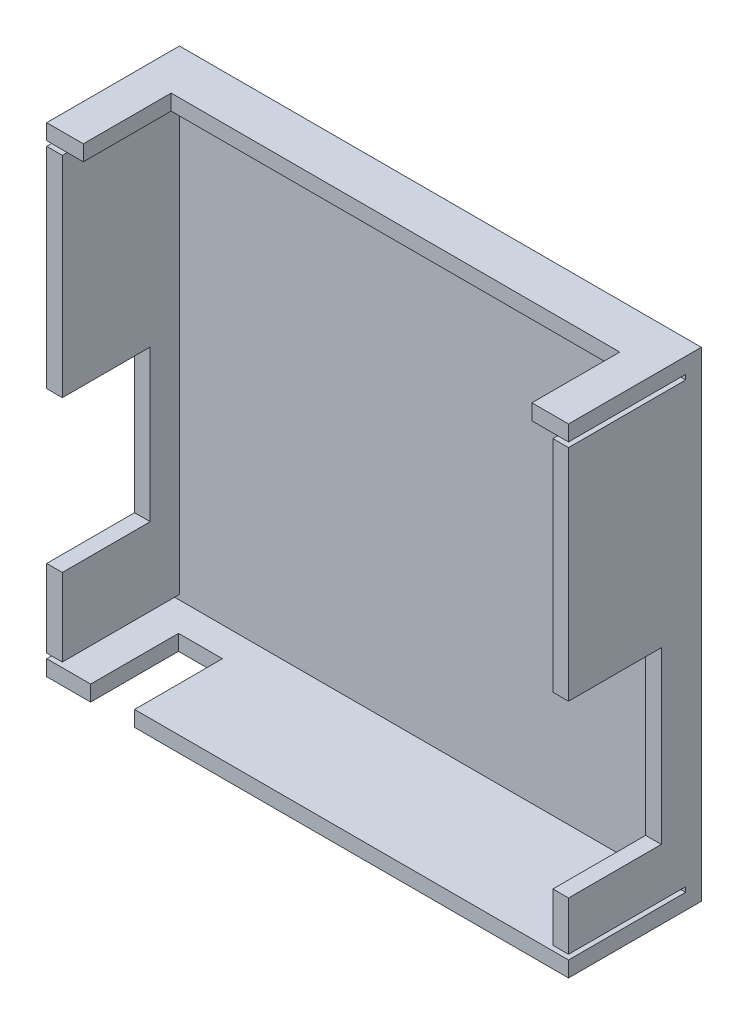
ISO-10303-21;
HEADER;
FILE_DESCRIPTION(('STEP AP214'),'2;1');
FILE_NAME('part.step','',(''),(''),'','','');
FILE_SCHEMA(('AUTOMOTIVE_DESIGN { 1 0 10303 214 1 1 1 1 }'));
ENDSEC;
DATA;
#1=APPLICATION_CONTEXT('core data for automotive mechanical design processes');
#2=APPLICATION_PROTOCOL_DEFINITION('international standard','automotive_design',2000,#1);
#3=PRODUCT_CONTEXT('',#1,'mechanical');
#4=PRODUCT('Part','Part','',(#3));
#5=PRODUCT_RELATED_PRODUCT_CATEGORY('part','',(#4));
#6=PRODUCT_DEFINITION_FORMATION('','',#4);
#7=PRODUCT_DEFINITION_CONTEXT('part definition',#1,'design');
#8=PRODUCT_DEFINITION('design','',#6,#7);
#9=PRODUCT_DEFINITION_SHAPE('','',#8);
#10=(LENGTH_UNIT() NAMED_UNIT(*) SI_UNIT(.MILLI.,.METRE.));
#11=(NAMED_UNIT(*) PLANE_ANGLE_UNIT() SI_UNIT($,.RADIAN.));
#12=(NAMED_UNIT(*) SI_UNIT($,.STERADIAN.) SOLID_ANGLE_UNIT());
#13=UNCERTAINTY_MEASURE_WITH_UNIT(LENGTH_MEASURE(1.E-05),#10,'distance_accuracy_value','');
#14=(GEOMETRIC_REPRESENTATION_CONTEXT(3) GLOBAL_UNCERTAINTY_ASSIGNED_CONTEXT((#13)) GLOBAL_UNIT_ASSIGNED_CONTEXT((#10,
#11,#12)) REPRESENTATION_CONTEXT('',''));
#15=CARTESIAN_POINT('',(0.,0.,0.));
#16=DIRECTION('',(0.,0.,1.));
#17=DIRECTION('',(1.,0.,0.));
#18=AXIS2_PLACEMENT_3D('',#15,#16,#17);
#19=CARTESIAN_POINT('',(0.,0.,27.2));
#20=DIRECTION('',(0.,0.,1.));
#21=DIRECTION('',(1.,0.,0.));
#22=AXIS2_PLACEMENT_3D('',#19,#20,#21);
#23=PLANE('',#22);
#24=DIRECTION('',(0.,1.,0.));
#25=VECTOR('',#24,1.);
#26=CARTESIAN_POINT('',(18.,3.19999999999998,27.2));
#27=LINE('',#26,#25);
#28=CARTESIAN_POINT('',(18.,0.,27.2));
#29=VERTEX_POINT('',#28);
#30=CARTESIAN_POINT('',(18.,3.19999999999998,27.2));
#31=VERTEX_POINT('',#30);
#32=EDGE_CURVE('E267',#29,#31,#27,.T.);
#33=ORIENTED_EDGE('',*,*,#32,.F.);
#34=DIRECTION('',(1.,0.,0.));
#35=VECTOR('',#34,1.);
#36=CARTESIAN_POINT('',(0.,0.,27.2));
#37=LINE('',#36,#35);
#38=CARTESIAN_POINT('',(106.9,0.,27.2));
#39=VERTEX_POINT('',#38);
#40=EDGE_CURVE('E512',#29,#39,#37,.T.);
#41=ORIENTED_EDGE('',*,*,#40,.T.);
#42=DIRECTION('',(0.,1.,0.));
#43=VECTOR('',#42,1.);
#44=CARTESIAN_POINT('',(106.9,0.,27.2));
#45=LINE('',#44,#43);
#46=CARTESIAN_POINT('',(106.9,3.2,27.2));
#47=VERTEX_POINT('',#46);
#48=EDGE_CURVE('E520',#39,#47,#45,.T.);
#49=ORIENTED_EDGE('',*,*,#48,.T.);
#50=DIRECTION('',(1.,0.,0.));
#51=VECTOR('',#50,1.);
#52=CARTESIAN_POINT('',(3.20000000000001,3.2,27.2));
#53=LINE('',#52,#51);
#54=EDGE_CURVE('E475',#31,#47,#53,.T.);
#55=ORIENTED_EDGE('',*,*,#54,.F.);
#56=EDGE_LOOP('',(#33,#41,#49,#55));
#57=FACE_BOUND('',#56,.T.);
#58=ADVANCED_FACE('F39',(#57),#23,.T.);
#59=DIRECTION('',(-1.,0.,0.));
#60=VECTOR('',#59,1.);
#61=CARTESIAN_POINT('',(103.7,49.1,27.2));
#62=LINE('',#61,#60);
#63=CARTESIAN_POINT('',(106.9,49.1,27.2));
#64=VERTEX_POINT('',#63);
#65=CARTESIAN_POINT('',(103.7,49.1,27.2));
#66=VERTEX_POINT('',#65);
#67=EDGE_CURVE('E286',#64,#66,#62,.T.);
#68=ORIENTED_EDGE('',*,*,#67,.F.);
#69=CARTESIAN_POINT('',(106.9,94.1,27.2));
#70=VERTEX_POINT('',#69);
#71=EDGE_CURVE('E526',#64,#70,#45,.T.);
#72=ORIENTED_EDGE('',*,*,#71,.T.);
#73=DIRECTION('',(-1.,0.,0.));
#74=VECTOR('',#73,1.);
#75=CARTESIAN_POINT('',(0.,94.1,27.2));
#76=LINE('',#75,#74);
#77=CARTESIAN_POINT('',(103.7,94.1,27.2));
#78=VERTEX_POINT('',#77);
#79=EDGE_CURVE('E398',#70,#78,#76,.T.);
#80=ORIENTED_EDGE('',*,*,#79,.T.);
#81=DIRECTION('',(0.,1.,0.));
#82=VECTOR('',#81,1.);
#83=CARTESIAN_POINT('',(103.7,3.2,27.2));
#84=LINE('',#83,#82);
#85=EDGE_CURVE('E479',#66,#78,#84,.T.);
#86=ORIENTED_EDGE('',*,*,#85,.F.);
#87=EDGE_LOOP('',(#68,#72,#80,#86));
#88=FACE_BOUND('',#87,.T.);
#89=ADVANCED_FACE('F694',(#88),#23,.T.);
#90=DIRECTION('',(0.,1.,0.));
#91=VECTOR('',#90,1.);
#92=CARTESIAN_POINT('',(99.4,95.1,27.2));
#93=LINE('',#92,#91);
#94=CARTESIAN_POINT('',(99.4,95.1,27.2));
#95=VERTEX_POINT('',#94);
#96=CARTESIAN_POINT('',(99.4,98.3,27.2));
#97=VERTEX_POINT('',#96);
#98=EDGE_CURVE('E321',#95,#97,#93,.T.);
#99=ORIENTED_EDGE('',*,*,#98,.F.);
#100=DIRECTION('',(-1.,0.,0.));
#101=VECTOR('',#100,1.);
#102=CARTESIAN_POINT('',(3.20000000000001,95.1,27.2));
#103=LINE('',#102,#101);
#104=CARTESIAN_POINT('',(106.9,95.1,27.2));
#105=VERTEX_POINT('',#104);
#106=EDGE_CURVE('E485',#105,#95,#103,.T.);
#107=ORIENTED_EDGE('',*,*,#106,.F.);
#108=CARTESIAN_POINT('',(106.9,98.3,27.2));
#109=VERTEX_POINT('',#108);
#110=EDGE_CURVE('E519',#105,#109,#45,.T.);
#111=ORIENTED_EDGE('',*,*,#110,.T.);
#112=DIRECTION('',(-1.,0.,0.));
#113=VECTOR('',#112,1.);
#114=CARTESIAN_POINT('',(106.9,98.3,27.2));
#115=LINE('',#114,#113);
#116=EDGE_CURVE('E503',#109,#97,#115,.T.);
#117=ORIENTED_EDGE('',*,*,#116,.T.);
#118=EDGE_LOOP('',(#99,#107,#111,#117));
#119=FACE_BOUND('',#118,.T.);
#120=ADVANCED_FACE('F667',(#119),#23,.T.);
#121=DIRECTION('',(-1.,0.,0.));
#122=VECTOR('',#121,1.);
#123=CARTESIAN_POINT('',(0.,51.1,27.2));
#124=LINE('',#123,#122);
#125=CARTESIAN_POINT('',(3.20000000000001,51.1,27.2));
#126=VERTEX_POINT('',#125);
#127=CARTESIAN_POINT('',(0.,51.1,27.2));
#128=VERTEX_POINT('',#127);
#129=EDGE_CURVE('E355',#126,#128,#124,.T.);
#130=ORIENTED_EDGE('',*,*,#129,.F.);
#131=DIRECTION('',(0.,-1.,0.));
#132=VECTOR('',#131,1.);
#133=CARTESIAN_POINT('',(3.20000000000001,3.2,27.2));
#134=LINE('',#133,#132);
#135=CARTESIAN_POINT('',(3.20000000000001,94.1,27.2));
#136=VERTEX_POINT('',#135);
#137=EDGE_CURVE('E471',#136,#126,#134,.T.);
#138=ORIENTED_EDGE('',*,*,#137,.F.);
#139=DIRECTION('',(1.,0.,0.));
#140=VECTOR('',#139,1.);
#141=CARTESIAN_POINT('',(0.,94.1,27.2));
#142=LINE('',#141,#140);
#143=CARTESIAN_POINT('',(0.,94.1,27.2));
#144=VERTEX_POINT('',#143);
#145=EDGE_CURVE('E402',#144,#136,#142,.T.);
#146=ORIENTED_EDGE('',*,*,#145,.F.);
#147=DIRECTION('',(0.,-1.,0.));
#148=VECTOR('',#147,1.);
#149=CARTESIAN_POINT('',(0.,98.3,27.2));
#150=LINE('',#149,#148);
#151=EDGE_CURVE('E513',#144,#128,#150,.T.);
#152=ORIENTED_EDGE('',*,*,#151,.T.);
#153=EDGE_LOOP('',(#130,#138,#146,#152));
#154=FACE_BOUND('',#153,.T.);
#155=ADVANCED_FACE('F644',(#154),#23,.T.);
#156=CARTESIAN_POINT('',(0.,0.,3.2));
#157=DIRECTION('',(1.,0.,0.));
#158=DIRECTION('',(0.,0.,-1.));
#159=AXIS2_PLACEMENT_3D('',#156,#157,#158);
#160=PLANE('',#159);
#161=DIRECTION('',(0.,-1.,0.));
#162=VECTOR('',#161,1.);
#163=CARTESIAN_POINT('',(0.,51.1,9.2));
#164=LINE('',#163,#162);
#165=CARTESIAN_POINT('',(0.,51.1,9.2));
#166=VERTEX_POINT('',#165);
#167=CARTESIAN_POINT('',(0.,20.1,9.2));
#168=VERTEX_POINT('',#167);
#169=EDGE_CURVE('E350',#166,#168,#164,.T.);
#170=ORIENTED_EDGE('',*,*,#169,.F.);
#171=DIRECTION('',(0.,0.,1.));
#172=VECTOR('',#171,1.);
#173=CARTESIAN_POINT('',(0.,51.1,9.2));
#174=LINE('',#173,#172);
#175=EDGE_CURVE('E370',#166,#128,#174,.T.);
#176=ORIENTED_EDGE('',*,*,#175,.T.);
#177=ORIENTED_EDGE('',*,*,#151,.F.);
#178=DIRECTION('',(0.,0.,1.));
#179=VECTOR('',#178,1.);
#180=CARTESIAN_POINT('',(0.,94.1,3.2));
#181=LINE('',#180,#179);
#182=CARTESIAN_POINT('',(0.,94.1,3.2));
#183=VERTEX_POINT('',#182);
#184=EDGE_CURVE('E457',#183,#144,#181,.T.);
#185=ORIENTED_EDGE('',*,*,#184,.F.);
#186=DIRECTION('',(0.,-1.,0.));
#187=VECTOR('',#186,1.);
#188=CARTESIAN_POINT('',(0.,0.,3.2));
#189=LINE('',#188,#187);
#190=CARTESIAN_POINT('',(0.,95.1,3.2));
#191=VERTEX_POINT('',#190);
#192=EDGE_CURVE('E450',#191,#183,#189,.T.);
#193=ORIENTED_EDGE('',*,*,#192,.F.);
#194=DIRECTION('',(0.,0.,1.));
#195=VECTOR('',#194,1.);
#196=CARTESIAN_POINT('',(0.,95.1,3.2));
#197=LINE('',#196,#195);
#198=CARTESIAN_POINT('',(0.,95.1,27.2));
#199=VERTEX_POINT('',#198);
#200=EDGE_CURVE('E460',#191,#199,#197,.T.);
#201=ORIENTED_EDGE('',*,*,#200,.T.);
#202=CARTESIAN_POINT('',(0.,98.3,27.2));
#203=VERTEX_POINT('',#202);
#204=EDGE_CURVE('E508',#203,#199,#150,.T.);
#205=ORIENTED_EDGE('',*,*,#204,.F.);
#206=DIRECTION('',(0.,0.,-1.));
#207=VECTOR('',#206,1.);
#208=CARTESIAN_POINT('',(0.,98.3,3.2));
#209=LINE('',#208,#207);
#210=CARTESIAN_POINT('',(0.,98.3,0.));
#211=VERTEX_POINT('',#210);
#212=EDGE_CURVE('E539',#203,#211,#209,.T.);
#213=ORIENTED_EDGE('',*,*,#212,.T.);
#214=DIRECTION('',(0.,-1.,0.));
#215=VECTOR('',#214,1.);
#216=CARTESIAN_POINT('',(0.,0.,0.));
#217=LINE('',#216,#215);
#218=CARTESIAN_POINT('',(0.,0.,0.));
#219=VERTEX_POINT('',#218);
#220=EDGE_CURVE('E524',#211,#219,#217,.T.);
#221=ORIENTED_EDGE('',*,*,#220,.T.);
#222=DIRECTION('',(0.,0.,-1.));
#223=VECTOR('',#222,1.);
#224=CARTESIAN_POINT('',(0.,0.,3.2));
#225=LINE('',#224,#223);
#226=CARTESIAN_POINT('',(0.,0.,27.2));
#227=VERTEX_POINT('',#226);
#228=EDGE_CURVE('E11',#227,#219,#225,.T.);
#229=ORIENTED_EDGE('',*,*,#228,.F.);
#230=CARTESIAN_POINT('',(0.,3.2,27.2));
#231=VERTEX_POINT('',#230);
#232=EDGE_CURVE('E507',#231,#227,#150,.T.);
#233=ORIENTED_EDGE('',*,*,#232,.F.);
#234=DIRECTION('',(0.,0.,1.));
#235=VECTOR('',#234,1.);
#236=CARTESIAN_POINT('',(0.,3.2,3.2));
#237=LINE('',#236,#235);
#238=CARTESIAN_POINT('',(0.,3.2,3.2));
#239=VERTEX_POINT('',#238);
#240=EDGE_CURVE('E437',#239,#231,#237,.T.);
#241=ORIENTED_EDGE('',*,*,#240,.F.);
#242=DIRECTION('',(0.,1.,0.));
#243=VECTOR('',#242,1.);
#244=CARTESIAN_POINT('',(0.,3.2,3.2));
#245=LINE('',#244,#243);
#246=CARTESIAN_POINT('',(0.,4.2,3.2));
#247=VERTEX_POINT('',#246);
#248=EDGE_CURVE('E444',#239,#247,#245,.T.);
#249=ORIENTED_EDGE('',*,*,#248,.T.);
#250=DIRECTION('',(0.,0.,1.));
#251=VECTOR('',#250,1.);
#252=CARTESIAN_POINT('',(0.,4.2,3.2));
#253=LINE('',#252,#251);
#254=CARTESIAN_POINT('',(0.,4.2,27.2));
#255=VERTEX_POINT('',#254);
#256=EDGE_CURVE('E374',#247,#255,#253,.T.);
#257=ORIENTED_EDGE('',*,*,#256,.T.);
#258=CARTESIAN_POINT('',(0.,20.1,27.2));
#259=VERTEX_POINT('',#258);
#260=EDGE_CURVE('E514',#259,#255,#150,.T.);
#261=ORIENTED_EDGE('',*,*,#260,.F.);
#262=DIRECTION('',(0.,0.,1.));
#263=VECTOR('',#262,1.);
#264=CARTESIAN_POINT('',(0.,20.1,9.2));
#265=LINE('',#264,#263);
#266=EDGE_CURVE('E365',#168,#259,#265,.T.);
#267=ORIENTED_EDGE('',*,*,#266,.F.);
#268=EDGE_LOOP('',(#170,#176,#177,#185,#193,#201,#205,#213,#221,#229,#233,#241,#249,#257,#261,#267));
#269=FACE_BOUND('',#268,.T.);
#270=ADVANCED_FACE('F41',(#269),#160,.F.);
#271=CARTESIAN_POINT('',(106.9,0.,3.2));
#272=DIRECTION('',(-1.,0.,0.));
#273=DIRECTION('',(0.,0.,1.));
#274=AXIS2_PLACEMENT_3D('',#271,#272,#273);
#275=PLANE('',#274);
#276=ORIENTED_EDGE('',*,*,#71,.F.);
#277=DIRECTION('',(0.,0.,1.));
#278=VECTOR('',#277,1.);
#279=CARTESIAN_POINT('',(106.9,49.1,8.2));
#280=LINE('',#279,#278);
#281=CARTESIAN_POINT('',(106.9,49.1,8.2));
#282=VERTEX_POINT('',#281);
#283=EDGE_CURVE('E307',#282,#64,#280,.T.);
#284=ORIENTED_EDGE('',*,*,#283,.F.);
#285=DIRECTION('',(0.,1.,0.));
#286=VECTOR('',#285,1.);
#287=CARTESIAN_POINT('',(106.9,14.2,8.2));
#288=LINE('',#287,#286);
#289=CARTESIAN_POINT('',(106.9,14.2,8.2));
#290=VERTEX_POINT('',#289);
#291=EDGE_CURVE('E290',#290,#282,#288,.T.);
#292=ORIENTED_EDGE('',*,*,#291,.F.);
#293=DIRECTION('',(0.,0.,1.));
#294=VECTOR('',#293,1.);
#295=CARTESIAN_POINT('',(106.9,14.2,8.2));
#296=LINE('',#295,#294);
#297=CARTESIAN_POINT('',(106.9,14.2,27.2));
#298=VERTEX_POINT('',#297);
#299=EDGE_CURVE('E310',#290,#298,#296,.T.);
#300=ORIENTED_EDGE('',*,*,#299,.T.);
#301=CARTESIAN_POINT('',(106.9,4.2,27.2));
#302=VERTEX_POINT('',#301);
#303=EDGE_CURVE('E525',#302,#298,#45,.T.);
#304=ORIENTED_EDGE('',*,*,#303,.F.);
#305=DIRECTION('',(0.,0.,1.));
#306=VECTOR('',#305,1.);
#307=CARTESIAN_POINT('',(106.9,4.2,3.2));
#308=LINE('',#307,#306);
#309=CARTESIAN_POINT('',(106.9,4.2,3.2));
#310=VERTEX_POINT('',#309);
#311=EDGE_CURVE('E409',#310,#302,#308,.T.);
#312=ORIENTED_EDGE('',*,*,#311,.F.);
#313=DIRECTION('',(0.,1.,0.));
#314=VECTOR('',#313,1.);
#315=CARTESIAN_POINT('',(106.9,0.,3.2));
#316=LINE('',#315,#314);
#317=CARTESIAN_POINT('',(106.9,3.2,3.2));
#318=VERTEX_POINT('',#317);
#319=EDGE_CURVE('E424',#318,#310,#316,.T.);
#320=ORIENTED_EDGE('',*,*,#319,.F.);
#321=DIRECTION('',(0.,0.,1.));
#322=VECTOR('',#321,1.);
#323=CARTESIAN_POINT('',(106.9,3.2,3.2));
#324=LINE('',#323,#322);
#325=EDGE_CURVE('E417',#318,#47,#324,.T.);
#326=ORIENTED_EDGE('',*,*,#325,.T.);
#327=ORIENTED_EDGE('',*,*,#48,.F.);
#328=DIRECTION('',(0.,0.,-1.));
#329=VECTOR('',#328,1.);
#330=CARTESIAN_POINT('',(106.9,0.,3.2));
#331=LINE('',#330,#329);
#332=CARTESIAN_POINT('',(106.9,0.,0.));
#333=VERTEX_POINT('',#332);
#334=EDGE_CURVE('E48',#39,#333,#331,.T.);
#335=ORIENTED_EDGE('',*,*,#334,.T.);
#336=DIRECTION('',(0.,1.,0.));
#337=VECTOR('',#336,1.);
#338=CARTESIAN_POINT('',(106.9,0.,0.));
#339=LINE('',#338,#337);
#340=CARTESIAN_POINT('',(106.9,98.3,0.));
#341=VERTEX_POINT('',#340);
#342=EDGE_CURVE('E533',#333,#341,#339,.T.);
#343=ORIENTED_EDGE('',*,*,#342,.T.);
#344=DIRECTION('',(0.,0.,-1.));
#345=VECTOR('',#344,1.);
#346=CARTESIAN_POINT('',(106.9,98.3,3.2));
#347=LINE('',#346,#345);
#348=EDGE_CURVE('E543',#109,#341,#347,.T.);
#349=ORIENTED_EDGE('',*,*,#348,.F.);
#350=ORIENTED_EDGE('',*,*,#110,.F.);
#351=DIRECTION('',(0.,0.,1.));
#352=VECTOR('',#351,1.);
#353=CARTESIAN_POINT('',(106.9,95.1,3.2));
#354=LINE('',#353,#352);
#355=CARTESIAN_POINT('',(106.9,95.1,3.2));
#356=VERTEX_POINT('',#355);
#357=EDGE_CURVE('E389',#356,#105,#354,.T.);
#358=ORIENTED_EDGE('',*,*,#357,.F.);
#359=DIRECTION('',(0.,1.,0.));
#360=VECTOR('',#359,1.);
#361=CARTESIAN_POINT('',(106.9,0.,3.2));
#362=LINE('',#361,#360);
#363=CARTESIAN_POINT('',(106.9,94.1,3.2));
#364=VERTEX_POINT('',#363);
#365=EDGE_CURVE('E388',#364,#356,#362,.T.);
#366=ORIENTED_EDGE('',*,*,#365,.F.);
#367=DIRECTION('',(0.,0.,1.));
#368=VECTOR('',#367,1.);
#369=CARTESIAN_POINT('',(106.9,94.1,3.2));
#370=LINE('',#369,#368);
#371=EDGE_CURVE('E384',#364,#70,#370,.T.);
#372=ORIENTED_EDGE('',*,*,#371,.T.);
#373=EDGE_LOOP('',(#276,#284,#292,#300,#304,#312,#320,#326,#327,#335,#343,#349,#350,#358,#366,#372));
#374=FACE_BOUND('',#373,.T.);
#375=ADVANCED_FACE('F553',(#374),#275,.F.);
#376=DIRECTION('',(1.,0.,0.));
#377=VECTOR('',#376,1.);
#378=CARTESIAN_POINT('',(0.,20.1,27.2));
#379=LINE('',#378,#377);
#380=CARTESIAN_POINT('',(3.20000000000001,20.1,27.2));
#381=VERTEX_POINT('',#380);
#382=EDGE_CURVE('E340',#259,#381,#379,.T.);
#383=ORIENTED_EDGE('',*,*,#382,.F.);
#384=ORIENTED_EDGE('',*,*,#260,.T.);
#385=DIRECTION('',(1.,0.,0.));
#386=VECTOR('',#385,1.);
#387=CARTESIAN_POINT('',(0.,4.2,27.2));
#388=LINE('',#387,#386);
#389=CARTESIAN_POINT('',(3.20000000000001,4.2,27.2));
#390=VERTEX_POINT('',#389);
#391=EDGE_CURVE('E421',#255,#390,#388,.T.);
#392=ORIENTED_EDGE('',*,*,#391,.T.);
#393=EDGE_CURVE('E476',#381,#390,#134,.T.);
#394=ORIENTED_EDGE('',*,*,#393,.F.);
#395=EDGE_LOOP('',(#383,#384,#392,#394));
#396=FACE_BOUND('',#395,.T.);
#397=ADVANCED_FACE('F625',(#396),#23,.T.);
#398=DIRECTION('',(0.,-1.,0.));
#399=VECTOR('',#398,1.);
#400=CARTESIAN_POINT('',(9.,3.19999999999998,27.2));
#401=LINE('',#400,#399);
#402=CARTESIAN_POINT('',(9.,3.19999999999998,27.2));
#403=VERTEX_POINT('',#402);
#404=CARTESIAN_POINT('',(9.,0.,27.2));
#405=VERTEX_POINT('',#404);
#406=EDGE_CURVE('E593',#403,#405,#401,.T.);
#407=ORIENTED_EDGE('',*,*,#406,.F.);
#408=EDGE_CURVE('E272',#231,#403,#53,.T.);
#409=ORIENTED_EDGE('',*,*,#408,.F.);
#410=ORIENTED_EDGE('',*,*,#232,.T.);
#411=EDGE_CURVE('E515',#227,#405,#37,.T.);
#412=ORIENTED_EDGE('',*,*,#411,.T.);
#413=EDGE_LOOP('',(#407,#409,#410,#412));
#414=FACE_BOUND('',#413,.T.);
#415=ADVANCED_FACE('F607',(#414),#23,.T.);
#416=DIRECTION('',(1.,0.,0.));
#417=VECTOR('',#416,1.);
#418=CARTESIAN_POINT('',(103.7,14.2,27.2));
#419=LINE('',#418,#417);
#420=CARTESIAN_POINT('',(103.7,14.2,27.2));
#421=VERTEX_POINT('',#420);
#422=EDGE_CURVE('E296',#421,#298,#419,.T.);
#423=ORIENTED_EDGE('',*,*,#422,.F.);
#424=CARTESIAN_POINT('',(103.7,4.2,27.2));
#425=VERTEX_POINT('',#424);
#426=EDGE_CURVE('E480',#425,#421,#84,.T.);
#427=ORIENTED_EDGE('',*,*,#426,.F.);
#428=DIRECTION('',(-1.,0.,0.));
#429=VECTOR('',#428,1.);
#430=CARTESIAN_POINT('',(0.,4.2,27.2));
#431=LINE('',#430,#429);
#432=EDGE_CURVE('E397',#302,#425,#431,.T.);
#433=ORIENTED_EDGE('',*,*,#432,.F.);
#434=ORIENTED_EDGE('',*,*,#303,.T.);
#435=EDGE_LOOP('',(#423,#427,#433,#434));
#436=FACE_BOUND('',#435,.T.);
#437=ADVANCED_FACE('F675',(#436),#23,.T.);
#438=DIRECTION('',(0.,-1.,0.));
#439=VECTOR('',#438,1.);
#440=CARTESIAN_POINT('',(7.49999999999999,98.3,27.2));
#441=LINE('',#440,#439);
#442=CARTESIAN_POINT('',(7.49999999999999,98.3,27.2));
#443=VERTEX_POINT('',#442);
#444=CARTESIAN_POINT('',(7.5,95.1,27.2));
#445=VERTEX_POINT('',#444);
#446=EDGE_CURVE('E306',#443,#445,#441,.T.);
#447=ORIENTED_EDGE('',*,*,#446,.F.);
#448=EDGE_CURVE('E489',#443,#203,#115,.T.);
#449=ORIENTED_EDGE('',*,*,#448,.T.);
#450=ORIENTED_EDGE('',*,*,#204,.T.);
#451=EDGE_CURVE('E484',#445,#199,#103,.T.);
#452=ORIENTED_EDGE('',*,*,#451,.F.);
#453=EDGE_LOOP('',(#447,#449,#450,#452));
#454=FACE_BOUND('',#453,.T.);
#455=ADVANCED_FACE('F576',(#454),#23,.T.);
#456=CARTESIAN_POINT('',(3.20000000000001,3.2,27.2));
#457=DIRECTION('',(1.,0.,0.));
#458=DIRECTION('',(0.,1.,0.));
#459=AXIS2_PLACEMENT_3D('',#456,#457,#458);
#460=PLANE('',#459);
#461=DIRECTION('',(0.,0.,1.));
#462=VECTOR('',#461,1.);
#463=CARTESIAN_POINT('',(3.20000000000001,51.1,9.2));
#464=LINE('',#463,#462);
#465=CARTESIAN_POINT('',(3.20000000000001,51.1,9.2));
#466=VERTEX_POINT('',#465);
#467=EDGE_CURVE('E375',#466,#126,#464,.T.);
#468=ORIENTED_EDGE('',*,*,#467,.F.);
#469=DIRECTION('',(0.,1.,0.));
#470=VECTOR('',#469,1.);
#471=CARTESIAN_POINT('',(3.20000000000001,20.1,9.2));
#472=LINE('',#471,#470);
#473=CARTESIAN_POINT('',(3.20000000000001,20.1,9.2));
#474=VERTEX_POINT('',#473);
#475=EDGE_CURVE('E358',#474,#466,#472,.T.);
#476=ORIENTED_EDGE('',*,*,#475,.F.);
#477=DIRECTION('',(0.,0.,1.));
#478=VECTOR('',#477,1.);
#479=CARTESIAN_POINT('',(3.20000000000001,20.1,9.2));
#480=LINE('',#479,#478);
#481=EDGE_CURVE('E378',#474,#381,#480,.T.);
#482=ORIENTED_EDGE('',*,*,#481,.T.);
#483=ORIENTED_EDGE('',*,*,#393,.T.);
#484=DIRECTION('',(0.,0.,1.));
#485=VECTOR('',#484,1.);
#486=CARTESIAN_POINT('',(3.20000000000001,4.2,3.2));
#487=LINE('',#486,#485);
#488=CARTESIAN_POINT('',(3.20000000000001,4.2,3.2));
#489=VERTEX_POINT('',#488);
#490=EDGE_CURVE('E433',#489,#390,#487,.T.);
#491=ORIENTED_EDGE('',*,*,#490,.F.);
#492=DIRECTION('',(0.,-1.,0.));
#493=VECTOR('',#492,1.);
#494=CARTESIAN_POINT('',(3.20000000000001,3.2,3.2));
#495=LINE('',#494,#493);
#496=CARTESIAN_POINT('',(3.20000000000001,94.1,3.2));
#497=VERTEX_POINT('',#496);
#498=EDGE_CURVE('E464',#497,#489,#495,.T.);
#499=ORIENTED_EDGE('',*,*,#498,.F.);
#500=DIRECTION('',(0.,0.,1.));
#501=VECTOR('',#500,1.);
#502=CARTESIAN_POINT('',(3.20000000000001,94.1,3.2));
#503=LINE('',#502,#501);
#504=EDGE_CURVE('E465',#497,#136,#503,.T.);
#505=ORIENTED_EDGE('',*,*,#504,.T.);
#506=ORIENTED_EDGE('',*,*,#137,.T.);
#507=EDGE_LOOP('',(#468,#476,#482,#483,#491,#499,#505,#506));
#508=FACE_BOUND('',#507,.T.);
#509=ADVANCED_FACE('F633',(#508),#460,.T.);
#510=CARTESIAN_POINT('',(103.7,3.2,27.2));
#511=DIRECTION('',(-1.,0.,0.));
#512=DIRECTION('',(0.,0.,1.));
#513=AXIS2_PLACEMENT_3D('',#510,#511,#512);
#514=PLANE('',#513);
#515=DIRECTION('',(0.,0.,1.));
#516=VECTOR('',#515,1.);
#517=CARTESIAN_POINT('',(103.7,49.1,8.2));
#518=LINE('',#517,#516);
#519=CARTESIAN_POINT('',(103.7,49.1,8.2));
#520=VERTEX_POINT('',#519);
#521=EDGE_CURVE('E302',#520,#66,#518,.T.);
#522=ORIENTED_EDGE('',*,*,#521,.T.);
#523=ORIENTED_EDGE('',*,*,#85,.T.);
#524=DIRECTION('',(0.,0.,1.));
#525=VECTOR('',#524,1.);
#526=CARTESIAN_POINT('',(103.7,94.1,3.2));
#527=LINE('',#526,#525);
#528=CARTESIAN_POINT('',(103.7,94.1,3.2));
#529=VERTEX_POINT('',#528);
#530=EDGE_CURVE('E393',#529,#78,#527,.T.);
#531=ORIENTED_EDGE('',*,*,#530,.F.);
#532=DIRECTION('',(0.,1.,0.));
#533=VECTOR('',#532,1.);
#534=CARTESIAN_POINT('',(103.7,3.2,3.2));
#535=LINE('',#534,#533);
#536=CARTESIAN_POINT('',(103.7,4.2,3.2));
#537=VERTEX_POINT('',#536);
#538=EDGE_CURVE('E496',#537,#529,#535,.T.);
#539=ORIENTED_EDGE('',*,*,#538,.F.);
#540=DIRECTION('',(0.,0.,1.));
#541=VECTOR('',#540,1.);
#542=CARTESIAN_POINT('',(103.7,4.2,3.2));
#543=LINE('',#542,#541);
#544=EDGE_CURVE('E413',#537,#425,#543,.T.);
#545=ORIENTED_EDGE('',*,*,#544,.T.);
#546=ORIENTED_EDGE('',*,*,#426,.T.);
#547=DIRECTION('',(0.,0.,1.));
#548=VECTOR('',#547,1.);
#549=CARTESIAN_POINT('',(103.7,14.2,8.2));
#550=LINE('',#549,#548);
#551=CARTESIAN_POINT('',(103.7,14.2,8.2));
#552=VERTEX_POINT('',#551);
#553=EDGE_CURVE('E295',#552,#421,#550,.T.);
#554=ORIENTED_EDGE('',*,*,#553,.F.);
#555=DIRECTION('',(0.,-1.,0.));
#556=VECTOR('',#555,1.);
#557=CARTESIAN_POINT('',(103.7,49.1,8.2));
#558=LINE('',#557,#556);
#559=EDGE_CURVE('E282',#520,#552,#558,.T.);
#560=ORIENTED_EDGE('',*,*,#559,.F.);
#561=EDGE_LOOP('',(#522,#523,#531,#539,#545,#546,#554,#560));
#562=FACE_BOUND('',#561,.T.);
#563=ADVANCED_FACE('F686',(#562),#514,.T.);
#564=CARTESIAN_POINT('',(0.,0.,3.2));
#565=DIRECTION('',(0.,1.,0.));
#566=DIRECTION('',(0.,0.,1.));
#567=AXIS2_PLACEMENT_3D('',#564,#565,#566);
#568=PLANE('',#567);
#569=ORIENTED_EDGE('',*,*,#40,.F.);
#570=DIRECTION('',(0.,0.,1.));
#571=VECTOR('',#570,1.);
#572=CARTESIAN_POINT('',(18.,0.,9.2));
#573=LINE('',#572,#571);
#574=CARTESIAN_POINT('',(18.,0.,9.2));
#575=VERTEX_POINT('',#574);
#576=EDGE_CURVE('E277',#575,#29,#573,.T.);
#577=ORIENTED_EDGE('',*,*,#576,.F.);
#578=DIRECTION('',(1.,0.,0.));
#579=VECTOR('',#578,1.);
#580=CARTESIAN_POINT('',(9.,0.,9.2));
#581=LINE('',#580,#579);
#582=CARTESIAN_POINT('',(9.,0.,9.2));
#583=VERTEX_POINT('',#582);
#584=EDGE_CURVE('E259',#583,#575,#581,.T.);
#585=ORIENTED_EDGE('',*,*,#584,.F.);
#586=DIRECTION('',(0.,0.,1.));
#587=VECTOR('',#586,1.);
#588=CARTESIAN_POINT('',(9.,0.,9.2));
#589=LINE('',#588,#587);
#590=EDGE_CURVE('E256',#583,#405,#589,.T.);
#591=ORIENTED_EDGE('',*,*,#590,.T.);
#592=ORIENTED_EDGE('',*,*,#411,.F.);
#593=ORIENTED_EDGE('',*,*,#228,.T.);
#594=DIRECTION('',(1.,0.,0.));
#595=VECTOR('',#594,1.);
#596=CARTESIAN_POINT('',(0.,0.,0.));
#597=LINE('',#596,#595);
#598=EDGE_CURVE('E530',#219,#333,#597,.T.);
#599=ORIENTED_EDGE('',*,*,#598,.T.);
#600=ORIENTED_EDGE('',*,*,#334,.F.);
#601=EDGE_LOOP('',(#569,#577,#585,#591,#592,#593,#599,#600));
#602=FACE_BOUND('',#601,.T.);
#603=ADVANCED_FACE('F598',(#602),#568,.F.);
#604=CARTESIAN_POINT('',(0.,98.3,3.2));
#605=DIRECTION('',(0.,-1.,0.));
#606=DIRECTION('',(0.,0.,-1.));
#607=AXIS2_PLACEMENT_3D('',#604,#605,#606);
#608=PLANE('',#607);
#609=DIRECTION('',(-1.,0.,0.));
#610=VECTOR('',#609,1.);
#611=CARTESIAN_POINT('',(99.4,98.3,9.2));
#612=LINE('',#611,#610);
#613=CARTESIAN_POINT('',(99.4,98.3,9.2));
#614=VERTEX_POINT('',#613);
#615=CARTESIAN_POINT('',(7.49999999999999,98.3,9.2));
#616=VERTEX_POINT('',#615);
#617=EDGE_CURVE('E316',#614,#616,#612,.T.);
#618=ORIENTED_EDGE('',*,*,#617,.F.);
#619=DIRECTION('',(0.,0.,1.));
#620=VECTOR('',#619,1.);
#621=CARTESIAN_POINT('',(99.4,98.3,9.2));
#622=LINE('',#621,#620);
#623=EDGE_CURVE('E336',#614,#97,#622,.T.);
#624=ORIENTED_EDGE('',*,*,#623,.T.);
#625=ORIENTED_EDGE('',*,*,#116,.F.);
#626=ORIENTED_EDGE('',*,*,#348,.T.);
#627=DIRECTION('',(-1.,0.,0.));
#628=VECTOR('',#627,1.);
#629=CARTESIAN_POINT('',(0.,98.3,0.));
#630=LINE('',#629,#628);
#631=EDGE_CURVE('E536',#341,#211,#630,.T.);
#632=ORIENTED_EDGE('',*,*,#631,.T.);
#633=ORIENTED_EDGE('',*,*,#212,.F.);
#634=ORIENTED_EDGE('',*,*,#448,.F.);
#635=DIRECTION('',(0.,0.,1.));
#636=VECTOR('',#635,1.);
#637=CARTESIAN_POINT('',(7.49999999999999,98.3,9.2));
#638=LINE('',#637,#636);
#639=EDGE_CURVE('E331',#616,#443,#638,.T.);
#640=ORIENTED_EDGE('',*,*,#639,.F.);
#641=EDGE_LOOP('',(#618,#624,#625,#626,#632,#633,#634,#640));
#642=FACE_BOUND('',#641,.T.);
#643=ADVANCED_FACE('F564',(#642),#608,.F.);
#644=CARTESIAN_POINT('',(0.,0.,0.));
#645=DIRECTION('',(0.,0.,-1.));
#646=DIRECTION('',(-1.,0.,0.));
#647=AXIS2_PLACEMENT_3D('',#644,#645,#646);
#648=PLANE('',#647);
#649=ORIENTED_EDGE('',*,*,#220,.F.);
#650=ORIENTED_EDGE('',*,*,#631,.F.);
#651=ORIENTED_EDGE('',*,*,#342,.F.);
#652=ORIENTED_EDGE('',*,*,#598,.F.);
#653=EDGE_LOOP('',(#649,#650,#651,#652));
#654=FACE_BOUND('',#653,.T.);
#655=ADVANCED_FACE('F560',(#654),#648,.T.);
#656=CARTESIAN_POINT('',(3.20000000000001,3.2,27.2));
#657=DIRECTION('',(0.,1.,0.));
#658=DIRECTION('',(0.,0.,1.));
#659=AXIS2_PLACEMENT_3D('',#656,#657,#658);
#660=PLANE('',#659);
#661=DIRECTION('',(0.,0.,1.));
#662=VECTOR('',#661,1.);
#663=CARTESIAN_POINT('',(18.,3.19999999999998,9.2));
#664=LINE('',#663,#662);
#665=CARTESIAN_POINT('',(18.,3.2,9.2));
#666=VERTEX_POINT('',#665);
#667=EDGE_CURVE('E299',#666,#31,#664,.T.);
#668=ORIENTED_EDGE('',*,*,#667,.T.);
#669=ORIENTED_EDGE('',*,*,#54,.T.);
#670=ORIENTED_EDGE('',*,*,#325,.F.);
#671=DIRECTION('',(1.,0.,0.));
#672=VECTOR('',#671,1.);
#673=CARTESIAN_POINT('',(3.20000000000001,3.2,3.2));
#674=LINE('',#673,#672);
#675=EDGE_CURVE('E493',#239,#318,#674,.T.);
#676=ORIENTED_EDGE('',*,*,#675,.F.);
#677=ORIENTED_EDGE('',*,*,#240,.T.);
#678=ORIENTED_EDGE('',*,*,#408,.T.);
#679=DIRECTION('',(0.,0.,1.));
#680=VECTOR('',#679,1.);
#681=CARTESIAN_POINT('',(9.,3.19999999999998,9.2));
#682=LINE('',#681,#680);
#683=CARTESIAN_POINT('',(9.,3.19999999999998,9.2));
#684=VERTEX_POINT('',#683);
#685=EDGE_CURVE('E253',#684,#403,#682,.T.);
#686=ORIENTED_EDGE('',*,*,#685,.F.);
#687=DIRECTION('',(-1.,0.,0.));
#688=VECTOR('',#687,1.);
#689=CARTESIAN_POINT('',(18.,3.19999999999998,9.2));
#690=LINE('',#689,#688);
#691=EDGE_CURVE('E260',#666,#684,#690,.T.);
#692=ORIENTED_EDGE('',*,*,#691,.F.);
#693=EDGE_LOOP('',(#668,#669,#670,#676,#677,#678,#686,#692));
#694=FACE_BOUND('',#693,.T.);
#695=ADVANCED_FACE('F270',(#694),#660,.T.);
#696=CARTESIAN_POINT('',(3.20000000000001,95.1,27.2));
#697=DIRECTION('',(0.,-1.,0.));
#698=DIRECTION('',(0.,0.,-1.));
#699=AXIS2_PLACEMENT_3D('',#696,#697,#698);
#700=PLANE('',#699);
#701=DIRECTION('',(0.,0.,1.));
#702=VECTOR('',#701,1.);
#703=CARTESIAN_POINT('',(99.4,95.1,9.2));
#704=LINE('',#703,#702);
#705=CARTESIAN_POINT('',(99.4,95.1,9.2));
#706=VERTEX_POINT('',#705);
#707=EDGE_CURVE('E341',#706,#95,#704,.T.);
#708=ORIENTED_EDGE('',*,*,#707,.F.);
#709=DIRECTION('',(1.,0.,0.));
#710=VECTOR('',#709,1.);
#711=CARTESIAN_POINT('',(7.5,95.1,9.2));
#712=LINE('',#711,#710);
#713=CARTESIAN_POINT('',(7.49999999999999,95.1,9.2));
#714=VERTEX_POINT('',#713);
#715=EDGE_CURVE('E324',#714,#706,#712,.T.);
#716=ORIENTED_EDGE('',*,*,#715,.F.);
#717=DIRECTION('',(0.,0.,1.));
#718=VECTOR('',#717,1.);
#719=CARTESIAN_POINT('',(7.5,95.1,9.2));
#720=LINE('',#719,#718);
#721=EDGE_CURVE('E344',#714,#445,#720,.T.);
#722=ORIENTED_EDGE('',*,*,#721,.T.);
#723=ORIENTED_EDGE('',*,*,#451,.T.);
#724=ORIENTED_EDGE('',*,*,#200,.F.);
#725=DIRECTION('',(-1.,0.,0.));
#726=VECTOR('',#725,1.);
#727=CARTESIAN_POINT('',(3.20000000000001,95.1,3.2));
#728=LINE('',#727,#726);
#729=EDGE_CURVE('E500',#356,#191,#728,.T.);
#730=ORIENTED_EDGE('',*,*,#729,.F.);
#731=ORIENTED_EDGE('',*,*,#357,.T.);
#732=ORIENTED_EDGE('',*,*,#106,.T.);
#733=EDGE_LOOP('',(#708,#716,#722,#723,#724,#730,#731,#732));
#734=FACE_BOUND('',#733,.T.);
#735=ADVANCED_FACE('F654',(#734),#700,.T.);
#736=CARTESIAN_POINT('',(0.,0.,3.2));
#737=DIRECTION('',(0.,0.,-1.));
#738=DIRECTION('',(-1.,0.,0.));
#739=AXIS2_PLACEMENT_3D('',#736,#737,#738);
#740=PLANE('',#739);
#741=ORIENTED_EDGE('',*,*,#729,.T.);
#742=ORIENTED_EDGE('',*,*,#192,.T.);
#743=DIRECTION('',(1.,0.,0.));
#744=VECTOR('',#743,1.);
#745=CARTESIAN_POINT('',(0.,94.1,3.2));
#746=LINE('',#745,#744);
#747=EDGE_CURVE('E454',#183,#497,#746,.T.);
#748=ORIENTED_EDGE('',*,*,#747,.T.);
#749=ORIENTED_EDGE('',*,*,#498,.T.);
#750=DIRECTION('',(1.,0.,0.));
#751=VECTOR('',#750,1.);
#752=CARTESIAN_POINT('',(0.,4.2,3.2));
#753=LINE('',#752,#751);
#754=EDGE_CURVE('E440',#247,#489,#753,.T.);
#755=ORIENTED_EDGE('',*,*,#754,.F.);
#756=ORIENTED_EDGE('',*,*,#248,.F.);
#757=ORIENTED_EDGE('',*,*,#675,.T.);
#758=ORIENTED_EDGE('',*,*,#319,.T.);
#759=DIRECTION('',(-1.,0.,0.));
#760=VECTOR('',#759,1.);
#761=CARTESIAN_POINT('',(0.,4.2,3.2));
#762=LINE('',#761,#760);
#763=EDGE_CURVE('E412',#310,#537,#762,.T.);
#764=ORIENTED_EDGE('',*,*,#763,.T.);
#765=ORIENTED_EDGE('',*,*,#538,.T.);
#766=DIRECTION('',(-1.,0.,0.));
#767=VECTOR('',#766,1.);
#768=CARTESIAN_POINT('',(0.,94.1,3.2));
#769=LINE('',#768,#767);
#770=EDGE_CURVE('E403',#364,#529,#769,.T.);
#771=ORIENTED_EDGE('',*,*,#770,.F.);
#772=ORIENTED_EDGE('',*,*,#365,.T.);
#773=EDGE_LOOP('',(#741,#742,#748,#749,#755,#756,#757,#758,#764,#765,#771,#772));
#774=FACE_BOUND('',#773,.T.);
#775=ADVANCED_FACE('F614',(#774),#740,.F.);
#776=CARTESIAN_POINT('',(0.,94.1,3.2));
#777=DIRECTION('',(0.,-1.,0.));
#778=DIRECTION('',(0.,0.,-1.));
#779=AXIS2_PLACEMENT_3D('',#776,#777,#778);
#780=PLANE('',#779);
#781=ORIENTED_EDGE('',*,*,#145,.T.);
#782=ORIENTED_EDGE('',*,*,#504,.F.);
#783=ORIENTED_EDGE('',*,*,#747,.F.);
#784=ORIENTED_EDGE('',*,*,#184,.T.);
#785=EDGE_LOOP('',(#781,#782,#783,#784));
#786=FACE_BOUND('',#785,.T.);
#787=ADVANCED_FACE('F648',(#786),#780,.F.);
#788=CARTESIAN_POINT('',(0.,94.1,3.2));
#789=DIRECTION('',(0.,1.,0.));
#790=DIRECTION('',(0.,0.,1.));
#791=AXIS2_PLACEMENT_3D('',#788,#789,#790);
#792=PLANE('',#791);
#793=ORIENTED_EDGE('',*,*,#79,.F.);
#794=ORIENTED_EDGE('',*,*,#371,.F.);
#795=ORIENTED_EDGE('',*,*,#770,.T.);
#796=ORIENTED_EDGE('',*,*,#530,.T.);
#797=EDGE_LOOP('',(#793,#794,#795,#796));
#798=FACE_BOUND('',#797,.T.);
#799=ADVANCED_FACE('F798',(#798),#792,.T.);
#800=CARTESIAN_POINT('',(0.,4.2,3.2));
#801=DIRECTION('',(0.,1.,0.));
#802=DIRECTION('',(0.,0.,1.));
#803=AXIS2_PLACEMENT_3D('',#800,#801,#802);
#804=PLANE('',#803);
#805=ORIENTED_EDGE('',*,*,#432,.T.);
#806=ORIENTED_EDGE('',*,*,#544,.F.);
#807=ORIENTED_EDGE('',*,*,#763,.F.);
#808=ORIENTED_EDGE('',*,*,#311,.T.);
#809=EDGE_LOOP('',(#805,#806,#807,#808));
#810=FACE_BOUND('',#809,.T.);
#811=ADVANCED_FACE('F691',(#810),#804,.F.);
#812=CARTESIAN_POINT('',(0.,4.2,3.2));
#813=DIRECTION('',(0.,-1.,0.));
#814=DIRECTION('',(0.,0.,-1.));
#815=AXIS2_PLACEMENT_3D('',#812,#813,#814);
#816=PLANE('',#815);
#817=ORIENTED_EDGE('',*,*,#391,.F.);
#818=ORIENTED_EDGE('',*,*,#256,.F.);
#819=ORIENTED_EDGE('',*,*,#754,.T.);
#820=ORIENTED_EDGE('',*,*,#490,.T.);
#821=EDGE_LOOP('',(#817,#818,#819,#820));
#822=FACE_BOUND('',#821,.T.);
#823=ADVANCED_FACE('F620',(#822),#816,.T.);
#824=CARTESIAN_POINT('',(0.,51.1,9.2));
#825=DIRECTION('',(0.,1.,0.));
#826=DIRECTION('',(0.,0.,1.));
#827=AXIS2_PLACEMENT_3D('',#824,#825,#826);
#828=PLANE('',#827);
#829=ORIENTED_EDGE('',*,*,#129,.T.);
#830=ORIENTED_EDGE('',*,*,#175,.F.);
#831=DIRECTION('',(-1.,0.,0.));
#832=VECTOR('',#831,1.);
#833=CARTESIAN_POINT('',(0.,51.1,9.2));
#834=LINE('',#833,#832);
#835=EDGE_CURVE('E361',#466,#166,#834,.T.);
#836=ORIENTED_EDGE('',*,*,#835,.F.);
#837=ORIENTED_EDGE('',*,*,#467,.T.);
#838=EDGE_LOOP('',(#829,#830,#836,#837));
#839=FACE_BOUND('',#838,.T.);
#840=ADVANCED_FACE('F638',(#839),#828,.F.);
#841=CARTESIAN_POINT('',(0.,20.1,9.2));
#842=DIRECTION('',(0.,-1.,0.));
#843=DIRECTION('',(0.,0.,-1.));
#844=AXIS2_PLACEMENT_3D('',#841,#842,#843);
#845=PLANE('',#844);
#846=ORIENTED_EDGE('',*,*,#382,.T.);
#847=ORIENTED_EDGE('',*,*,#481,.F.);
#848=DIRECTION('',(1.,0.,0.));
#849=VECTOR('',#848,1.);
#850=CARTESIAN_POINT('',(0.,20.1,9.2));
#851=LINE('',#850,#849);
#852=EDGE_CURVE('E354',#168,#474,#851,.T.);
#853=ORIENTED_EDGE('',*,*,#852,.F.);
#854=ORIENTED_EDGE('',*,*,#266,.T.);
#855=EDGE_LOOP('',(#846,#847,#853,#854));
#856=FACE_BOUND('',#855,.T.);
#857=ADVANCED_FACE('F629',(#856),#845,.F.);
#858=CARTESIAN_POINT('',(0.,0.,9.2));
#859=DIRECTION('',(0.,0.,1.));
#860=DIRECTION('',(1.,0.,0.));
#861=AXIS2_PLACEMENT_3D('',#858,#859,#860);
#862=PLANE('',#861);
#863=ORIENTED_EDGE('',*,*,#169,.T.);
#864=ORIENTED_EDGE('',*,*,#852,.T.);
#865=ORIENTED_EDGE('',*,*,#475,.T.);
#866=ORIENTED_EDGE('',*,*,#835,.T.);
#867=EDGE_LOOP('',(#863,#864,#865,#866));
#868=FACE_BOUND('',#867,.T.);
#869=ADVANCED_FACE('F636',(#868),#862,.T.);
#870=CARTESIAN_POINT('',(99.4,95.1,9.2));
#871=DIRECTION('',(1.,0.,0.));
#872=DIRECTION('',(0.,0.,-1.));
#873=AXIS2_PLACEMENT_3D('',#870,#871,#872);
#874=PLANE('',#873);
#875=ORIENTED_EDGE('',*,*,#98,.T.);
#876=ORIENTED_EDGE('',*,*,#623,.F.);
#877=DIRECTION('',(0.,1.,0.));
#878=VECTOR('',#877,1.);
#879=CARTESIAN_POINT('',(99.4,95.1,9.2));
#880=LINE('',#879,#878);
#881=EDGE_CURVE('E327',#706,#614,#880,.T.);
#882=ORIENTED_EDGE('',*,*,#881,.F.);
#883=ORIENTED_EDGE('',*,*,#707,.T.);
#884=EDGE_LOOP('',(#875,#876,#882,#883));
#885=FACE_BOUND('',#884,.T.);
#886=ADVANCED_FACE('F663',(#885),#874,.F.);
#887=CARTESIAN_POINT('',(7.49999999999999,98.3,9.2));
#888=DIRECTION('',(-1.,0.,0.));
#889=DIRECTION('',(0.,-1.,0.));
#890=AXIS2_PLACEMENT_3D('',#887,#888,#889);
#891=PLANE('',#890);
#892=ORIENTED_EDGE('',*,*,#446,.T.);
#893=ORIENTED_EDGE('',*,*,#721,.F.);
#894=DIRECTION('',(0.,-1.,0.));
#895=VECTOR('',#894,1.);
#896=CARTESIAN_POINT('',(7.49999999999999,98.3,9.2));
#897=LINE('',#896,#895);
#898=EDGE_CURVE('E320',#616,#714,#897,.T.);
#899=ORIENTED_EDGE('',*,*,#898,.F.);
#900=ORIENTED_EDGE('',*,*,#639,.T.);
#901=EDGE_LOOP('',(#892,#893,#899,#900));
#902=FACE_BOUND('',#901,.T.);
#903=ADVANCED_FACE('F658',(#902),#891,.F.);
#904=CARTESIAN_POINT('',(0.,0.,9.2));
#905=DIRECTION('',(0.,0.,1.));
#906=DIRECTION('',(1.,0.,0.));
#907=AXIS2_PLACEMENT_3D('',#904,#905,#906);
#908=PLANE('',#907);
#909=ORIENTED_EDGE('',*,*,#617,.T.);
#910=ORIENTED_EDGE('',*,*,#898,.T.);
#911=ORIENTED_EDGE('',*,*,#715,.T.);
#912=ORIENTED_EDGE('',*,*,#881,.T.);
#913=EDGE_LOOP('',(#909,#910,#911,#912));
#914=FACE_BOUND('',#913,.T.);
#915=ADVANCED_FACE('F660',(#914),#908,.T.);
#916=CARTESIAN_POINT('',(103.7,49.1,8.2));
#917=DIRECTION('',(0.,1.,0.));
#918=DIRECTION('',(0.,0.,1.));
#919=AXIS2_PLACEMENT_3D('',#916,#917,#918);
#920=PLANE('',#919);
#921=ORIENTED_EDGE('',*,*,#67,.T.);
#922=ORIENTED_EDGE('',*,*,#521,.F.);
#923=DIRECTION('',(-1.,0.,0.));
#924=VECTOR('',#923,1.);
#925=CARTESIAN_POINT('',(103.7,49.1,8.2));
#926=LINE('',#925,#924);
#927=EDGE_CURVE('E63',#282,#520,#926,.T.);
#928=ORIENTED_EDGE('',*,*,#927,.F.);
#929=ORIENTED_EDGE('',*,*,#283,.T.);
#930=EDGE_LOOP('',(#921,#922,#928,#929));
#931=FACE_BOUND('',#930,.T.);
#932=ADVANCED_FACE('F780',(#931),#920,.F.);
#933=CARTESIAN_POINT('',(103.7,14.2,8.2));
#934=DIRECTION('',(0.,-1.,0.));
#935=DIRECTION('',(1.,0.,0.));
#936=AXIS2_PLACEMENT_3D('',#933,#934,#935);
#937=PLANE('',#936);
#938=ORIENTED_EDGE('',*,*,#422,.T.);
#939=ORIENTED_EDGE('',*,*,#299,.F.);
#940=DIRECTION('',(1.,0.,0.));
#941=VECTOR('',#940,1.);
#942=CARTESIAN_POINT('',(103.7,14.2,8.2));
#943=LINE('',#942,#941);
#944=EDGE_CURVE('E285',#552,#290,#943,.T.);
#945=ORIENTED_EDGE('',*,*,#944,.F.);
#946=ORIENTED_EDGE('',*,*,#553,.T.);
#947=EDGE_LOOP('',(#938,#939,#945,#946));
#948=FACE_BOUND('',#947,.T.);
#949=ADVANCED_FACE('F681',(#948),#937,.F.);
#950=CARTESIAN_POINT('',(0.,0.,8.2));
#951=DIRECTION('',(0.,0.,1.));
#952=DIRECTION('',(1.,0.,0.));
#953=AXIS2_PLACEMENT_3D('',#950,#951,#952);
#954=PLANE('',#953);
#955=ORIENTED_EDGE('',*,*,#559,.T.);
#956=ORIENTED_EDGE('',*,*,#944,.T.);
#957=ORIENTED_EDGE('',*,*,#291,.T.);
#958=ORIENTED_EDGE('',*,*,#927,.T.);
#959=EDGE_LOOP('',(#955,#956,#957,#958));
#960=FACE_BOUND('',#959,.T.);
#961=ADVANCED_FACE('F682',(#960),#954,.T.);
#962=CARTESIAN_POINT('',(18.,3.19999999999998,9.2));
#963=DIRECTION('',(1.,0.,0.));
#964=DIRECTION('',(0.,0.,-1.));
#965=AXIS2_PLACEMENT_3D('',#962,#963,#964);
#966=PLANE('',#965);
#967=ORIENTED_EDGE('',*,*,#32,.T.);
#968=ORIENTED_EDGE('',*,*,#667,.F.);
#969=DIRECTION('',(0.,1.,0.));
#970=VECTOR('',#969,1.);
#971=CARTESIAN_POINT('',(18.,3.19999999999998,9.2));
#972=LINE('',#971,#970);
#973=EDGE_CURVE('E55',#575,#666,#972,.T.);
#974=ORIENTED_EDGE('',*,*,#973,.F.);
#975=ORIENTED_EDGE('',*,*,#576,.T.);
#976=EDGE_LOOP('',(#967,#968,#974,#975));
#977=FACE_BOUND('',#976,.T.);
#978=ADVANCED_FACE('F597',(#977),#966,.F.);
#979=CARTESIAN_POINT('',(9.,3.19999999999998,9.2));
#980=DIRECTION('',(-1.,0.,0.));
#981=DIRECTION('',(0.,0.,1.));
#982=AXIS2_PLACEMENT_3D('',#979,#980,#981);
#983=PLANE('',#982);
#984=ORIENTED_EDGE('',*,*,#406,.T.);
#985=ORIENTED_EDGE('',*,*,#590,.F.);
#986=DIRECTION('',(0.,-1.,0.));
#987=VECTOR('',#986,1.);
#988=CARTESIAN_POINT('',(9.,3.19999999999998,9.2));
#989=LINE('',#988,#987);
#990=EDGE_CURVE('E250',#684,#583,#989,.T.);
#991=ORIENTED_EDGE('',*,*,#990,.F.);
#992=ORIENTED_EDGE('',*,*,#685,.T.);
#993=EDGE_LOOP('',(#984,#985,#991,#992));
#994=FACE_BOUND('',#993,.T.);
#995=ADVANCED_FACE('F251',(#994),#983,.F.);
#996=CARTESIAN_POINT('',(0.,0.,9.2));
#997=DIRECTION('',(0.,0.,1.));
#998=DIRECTION('',(1.,0.,0.));
#999=AXIS2_PLACEMENT_3D('',#996,#997,#998);
#1000=PLANE('',#999);
#1001=ORIENTED_EDGE('',*,*,#691,.T.);
#1002=ORIENTED_EDGE('',*,*,#990,.T.);
#1003=ORIENTED_EDGE('',*,*,#584,.T.);
#1004=ORIENTED_EDGE('',*,*,#973,.T.);
#1005=EDGE_LOOP('',(#1001,#1002,#1003,#1004));
#1006=FACE_BOUND('',#1005,.T.);
#1007=ADVANCED_FACE('F263',(#1006),#1000,.T.);
#1008=CLOSED_SHELL('',(#58,#89,#120,#155,#270,#375,#397,#415,#437,#455,#509,#563,#603,#643,#655,
#695,#735,#775,#787,#799,#811,#823,#840,#857,#869,#886,#903,#915,#932,#949,#961,#978,#995,#1007));
#1009=MANIFOLD_SOLID_BREP('B2',#1008);
#1010=ADVANCED_BREP_SHAPE_REPRESENTATION('',(#18,#1009),#14);
#1011=SHAPE_DEFINITION_REPRESENTATION(#9,#1010);
ENDSEC;
END-ISO-10303-21;
